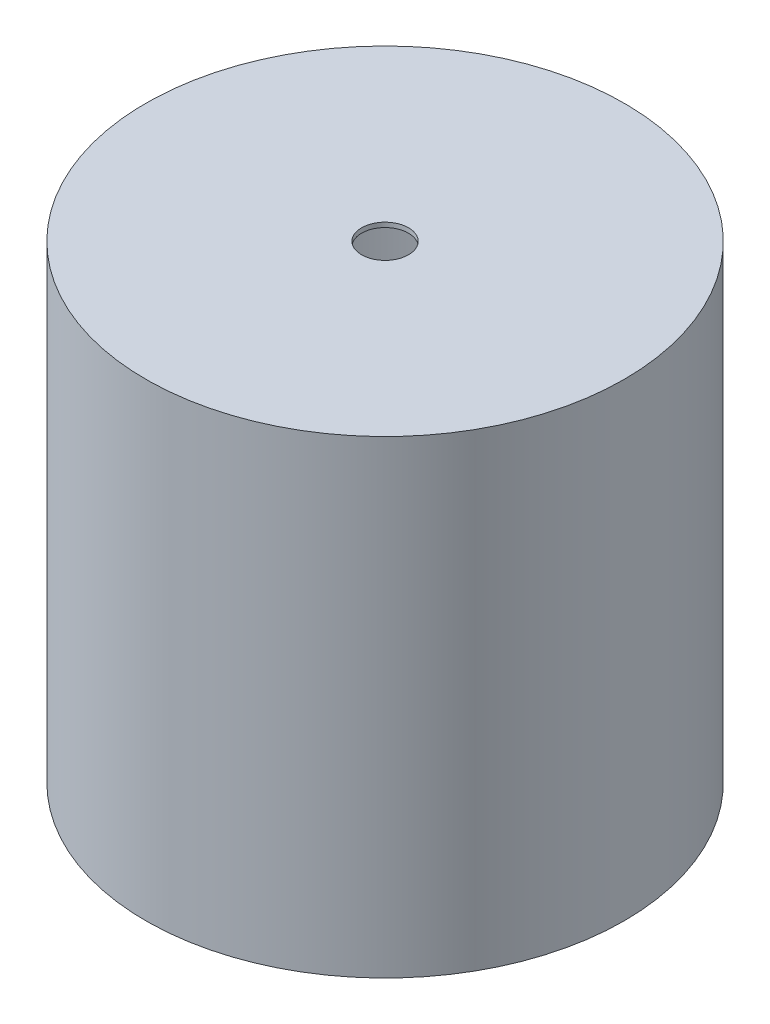
ISO-10303-21;
HEADER;
FILE_DESCRIPTION(('STEP AP214'),'2;1');
FILE_NAME('part.step','',(''),(''),'','','');
FILE_SCHEMA(('AUTOMOTIVE_DESIGN { 1 0 10303 214 1 1 1 1 }'));
ENDSEC;
DATA;
#1=APPLICATION_CONTEXT('core data for automotive mechanical design processes');
#2=APPLICATION_PROTOCOL_DEFINITION('international standard','automotive_design',2000,#1);
#3=PRODUCT_CONTEXT('',#1,'mechanical');
#4=PRODUCT('Part','Part','',(#3));
#5=PRODUCT_RELATED_PRODUCT_CATEGORY('part','',(#4));
#6=PRODUCT_DEFINITION_FORMATION('','',#4);
#7=PRODUCT_DEFINITION_CONTEXT('part definition',#1,'design');
#8=PRODUCT_DEFINITION('design','',#6,#7);
#9=PRODUCT_DEFINITION_SHAPE('','',#8);
#10=(LENGTH_UNIT() NAMED_UNIT(*) SI_UNIT(.MILLI.,.METRE.));
#11=(NAMED_UNIT(*) PLANE_ANGLE_UNIT() SI_UNIT($,.RADIAN.));
#12=(NAMED_UNIT(*) SI_UNIT($,.STERADIAN.) SOLID_ANGLE_UNIT());
#13=UNCERTAINTY_MEASURE_WITH_UNIT(LENGTH_MEASURE(1.E-05),#10,'distance_accuracy_value','');
#14=(GEOMETRIC_REPRESENTATION_CONTEXT(3) GLOBAL_UNCERTAINTY_ASSIGNED_CONTEXT((#13)) GLOBAL_UNIT_ASSIGNED_CONTEXT((#10,
#11,#12)) REPRESENTATION_CONTEXT('',''));
#15=CARTESIAN_POINT('',(0.,0.,0.));
#16=DIRECTION('',(0.,0.,1.));
#17=DIRECTION('',(1.,0.,0.));
#18=AXIS2_PLACEMENT_3D('',#15,#16,#17);
#19=CARTESIAN_POINT('',(0.,100.,0.));
#20=DIRECTION('',(0.,-1.,0.));
#21=DIRECTION('',(0.,0.,-1.));
#22=AXIS2_PLACEMENT_3D('',#19,#20,#21);
#23=CYLINDRICAL_SURFACE('',#22,5.);
#24=CARTESIAN_POINT('',(0.,0.,0.));
#25=DIRECTION('',(0.,-1.,0.));
#26=DIRECTION('',(0.,0.,-1.));
#27=AXIS2_PLACEMENT_3D('',#24,#25,#26);
#28=CIRCLE('',#27,5.);
#29=CARTESIAN_POINT('',(0.,0.,-5.));
#30=VERTEX_POINT('',#29);
#31=EDGE_CURVE('E70',#30,#30,#28,.T.);
#32=ORIENTED_EDGE('',*,*,#31,.T.);
#33=EDGE_LOOP('',(#32));
#34=FACE_BOUND('',#33,.T.);
#35=CARTESIAN_POINT('',(0.,10.,0.));
#36=DIRECTION('',(0.,-1.,0.));
#37=DIRECTION('',(0.,0.,-1.));
#38=AXIS2_PLACEMENT_3D('',#35,#36,#37);
#39=CIRCLE('',#38,5.);
#40=CARTESIAN_POINT('',(0.,10.,-5.));
#41=VERTEX_POINT('',#40);
#42=EDGE_CURVE('E146',#41,#41,#39,.T.);
#43=ORIENTED_EDGE('',*,*,#42,.F.);
#44=EDGE_LOOP('',(#43));
#45=FACE_BOUND('',#44,.T.);
#46=CARTESIAN_POINT('',(-2.5,5.,4.33012701892219));
#47=CARTESIAN_POINT('',(-2.49998948436432,5.13026650687649,4.33013982272991));
#48=CARTESIAN_POINT('',(-2.48974954513168,5.26070272067625,4.33609541965583));
#49=CARTESIAN_POINT('',(-2.44930840724944,5.51756897152923,4.35905877051907));
#50=CARTESIAN_POINT('',(-2.41906526369545,5.64399000405729,4.37608974726023));
#51=CARTESIAN_POINT('',(-2.3402497699757,5.88862894556107,4.41873376871659));
#52=CARTESIAN_POINT('',(-2.29177485369963,6.00688657356221,4.44430111338921));
#53=CARTESIAN_POINT('',(-2.17816884056414,6.23356056309455,4.50106659111455));
#54=CARTESIAN_POINT('',(-2.11303684262671,6.34197639179579,4.53226502875883));
#55=CARTESIAN_POINT('',(-1.96166634317253,6.55576430391692,4.59992173524851));
#56=CARTESIAN_POINT('',(-1.87413008816917,6.66014783448977,4.63660159331577));
#57=CARTESIAN_POINT('',(-1.68313452122752,6.8535209757132,4.70929956727453));
#58=CARTESIAN_POINT('',(-1.57966731506052,6.94250290775495,4.74531734512768));
#59=CARTESIAN_POINT('',(-1.35122390789082,7.10841787648564,4.81553692452135));
#60=CARTESIAN_POINT('',(-1.22526797235894,7.18413441927914,4.84945266064072));
#61=CARTESIAN_POINT('',(-0.960392566671148,7.31285213348386,4.90876890230193));
#62=CARTESIAN_POINT('',(-0.821481345389984,7.3658676404385,4.93417477954535));
#63=CARTESIAN_POINT('',(-0.545112359773524,7.44376165316397,4.9720115311507));
#64=CARTESIAN_POINT('',(-0.408254476210984,7.47037381586513,4.98523700553425));
#65=CARTESIAN_POINT('',(-0.131426571755677,7.50041529671129,5.00018959613973));
#66=CARTESIAN_POINT('',(0.00854151460650773,7.50385864199536,5.00192366961168));
#67=CARTESIAN_POINT('',(0.274581311061964,7.48813331506858,4.99407454791405));
#68=CARTESIAN_POINT('',(0.400802997942671,7.47090496119546,4.98546239730476));
#69=CARTESIAN_POINT('',(0.648284429795109,7.41779789023985,4.95935613149294));
#70=CARTESIAN_POINT('',(0.769543802734625,7.38191777755985,4.94186135165964));
#71=CARTESIAN_POINT('',(1.00577347892407,7.29229358477506,4.89928958219157));
#72=CARTESIAN_POINT('',(1.120633558788,7.23830921706972,4.87411103823003));
#73=CARTESIAN_POINT('',(1.33994200378327,7.11434145949638,4.81844114966712));
#74=CARTESIAN_POINT('',(1.4443866220966,7.04435234174416,4.78794790393709));
#75=CARTESIAN_POINT('',(1.6504341522455,6.88276162116743,4.72110985998075));
#76=CARTESIAN_POINT('',(1.75083518757341,6.78974242918497,4.68448439995438));
#77=CARTESIAN_POINT('',(1.93526092574445,6.58852568767457,4.61135851467029));
#78=CARTESIAN_POINT('',(2.01927302893558,6.48031656931485,4.57485820664072));
#79=CARTESIAN_POINT('',(2.17376333660553,6.24337951893978,4.50360390231212));
#80=CARTESIAN_POINT('',(2.24304328744513,6.11378494236447,4.46910799976769));
#81=CARTESIAN_POINT('',(2.35829778250308,5.84265582160251,4.4093862569644));
#82=CARTESIAN_POINT('',(2.40429664552722,5.7011339174561,4.38415075115168));
#83=CARTESIAN_POINT('',(2.4679505275626,5.42196372179303,4.34861589542586));
#84=CARTESIAN_POINT('',(2.48756280529994,5.28489720239113,4.33729139621241));
#85=CARTESIAN_POINT('',(2.50379236652857,5.00899664620864,4.32794798404024));
#86=CARTESIAN_POINT('',(2.50042589328757,4.87016392720051,4.32991967223279));
#87=CARTESIAN_POINT('',(2.47259010835991,4.6108652035532,4.34585841351462));
#88=CARTESIAN_POINT('',(2.45046954178116,4.49005137223027,4.35848968766635));
#89=CARTESIAN_POINT('',(2.38924071158112,4.25408053432252,4.39235053878353));
#90=CARTESIAN_POINT('',(2.35012694655908,4.13892537313315,4.41358290012585));
#91=CARTESIAN_POINT('',(2.25411897151217,3.91147167274361,4.46340555199141));
#92=CARTESIAN_POINT('',(2.19648515923163,3.79955245786744,4.49229108107657));
#93=CARTESIAN_POINT('',(2.0657176600397,3.5863268211512,4.55390298743125));
#94=CARTESIAN_POINT('',(1.99257601083123,3.48502589121186,4.58663133387872));
#95=CARTESIAN_POINT('',(1.82209291799636,3.28255308119668,4.65719996140836));
#96=CARTESIAN_POINT('',(1.72286318078435,3.18300712322778,4.69516457885708));
#97=CARTESIAN_POINT('',(1.5085112384988,3.00146940499409,4.76835587444746));
#98=CARTESIAN_POINT('',(1.39338368664989,2.91948357434145,4.80358162519329));
#99=CARTESIAN_POINT('',(1.14633840638508,2.77356568520911,4.86853404227334));
#100=CARTESIAN_POINT('',(1.01405774389062,2.71016720479154,4.89809104179855));
#101=CARTESIAN_POINT('',(0.738805911647334,2.60715524003798,4.9470838739847));
#102=CARTESIAN_POINT('',(0.595844253647069,2.56752087039488,4.96652859191746));
#103=CARTESIAN_POINT('',(0.317449205674708,2.51657859064358,4.99168770453968));
#104=CARTESIAN_POINT('',(0.182528609085378,2.50300531416965,4.99849819767838));
#105=CARTESIAN_POINT('',(-0.0878149643374293,2.49789183250541,5.00105325940467));
#106=CARTESIAN_POINT('',(-0.223237748727015,2.50634391433891,4.99680170177042));
#107=CARTESIAN_POINT('',(-0.481344982671071,2.5435410303955,4.97834922085637));
#108=CARTESIAN_POINT('',(-0.604280801321771,2.57091217163631,4.96482236636807));
#109=CARTESIAN_POINT('',(-0.843614873664453,2.64331744975833,4.92980234191731));
#110=CARTESIAN_POINT('',(-0.960012187087212,2.68835411963363,4.90830802955518));
#111=CARTESIAN_POINT('',(-1.18855854199593,2.79681781873926,4.85814826741488));
#112=CARTESIAN_POINT('',(-1.30031295715363,2.86094902468984,4.82921542506803));
#113=CARTESIAN_POINT('',(-1.51193650408535,3.00489411014759,4.76720333344986));
#114=CARTESIAN_POINT('',(-1.61180014305397,3.08471519262687,4.73412218229104));
#115=CARTESIAN_POINT('',(-1.8072854232437,3.26699579444936,4.66321523550925));
#116=CARTESIAN_POINT('',(-1.90149582349003,3.37091772600073,4.62524489658366));
#117=CARTESIAN_POINT('',(-2.07165660492503,3.59361528538223,4.55157698284941));
#118=CARTESIAN_POINT('',(-2.1475908315154,3.71240391419923,4.51588143910584));
#119=CARTESIAN_POINT('',(-2.28108393396028,3.96663611766426,4.44998982823926));
#120=CARTESIAN_POINT('',(-2.3379862797745,4.1024873884246,4.42000320346984));
#121=CARTESIAN_POINT('',(-2.40494911880459,4.31322264951977,4.38370272660093));
#122=CARTESIAN_POINT('',(-2.42419582683991,4.38455977569761,4.37305486646054));
#123=CARTESIAN_POINT('',(-2.45635087255789,4.52904069684933,4.35507574170935));
#124=CARTESIAN_POINT('',(-2.46926364179177,4.60218319095441,4.34774215854234));
#125=CARTESIAN_POINT('',(-2.48591166201423,4.72950098654694,4.3382377954292));
#126=CARTESIAN_POINT('',(-2.49118864979202,4.78341632151221,4.33520487024791));
#127=CARTESIAN_POINT('',(-2.49823512543934,4.89154461631041,4.33114674911323));
#128=CARTESIAN_POINT('',(-2.50000437866475,4.94575759581055,4.33012168747261));
#129=CARTESIAN_POINT('',(-2.5,5.,4.33012701892219));
#130=B_SPLINE_CURVE_WITH_KNOTS('',3,(#46,#47,#48,#49,#50,#51,#52,#53,#54,#55,#56,#57,#58,#59,
#60,#61,#62,#63,#64,#65,#66,#67,#68,#69,#70,#71,#72,#73,#74,#75,#76,#77,#78,#79,#80,#81,#82,#83,
#84,#85,#86,#87,#88,#89,#90,#91,#92,#93,#94,#95,#96,#97,#98,#99,#100,#101,#102,#103,#104,#105,
#106,#107,#108,#109,#110,#111,#112,#113,#114,#115,#116,#117,#118,#119,#120,#121,#122,#123,#124,
#125,#126,#127,#128,#129),.UNSPECIFIED.,.T.,.F.,(4,2,2,2,2,2,2,2,2,2,2,2,2,2,2,2,2,2,2,2,2,2,2,
2,2,2,2,2,2,2,2,2,2,2,2,2,2,2,2,2,2,4),(0.,0.390580306486789,0.781982232062012,1.17132148982692,
1.56068181366371,1.98215578129642,2.40383927716011,2.85394730601992,3.30377067414811,
3.72158712424921,4.13915059220183,4.52040243716429,4.90168281298721,5.2882383683295,
5.67493248380763,6.0981797864731,6.5217512061988,6.97222104328704,7.42221935534346,
7.83655727140613,8.25060232976016,8.61935458565148,8.98822631095241,9.37418241020303,
9.76033715555202,10.1951685895662,10.6301466245059,11.076604535375,11.5226694952701,
11.927806759788,12.3328021699001,12.7111106218382,13.0894733378512,13.4840187680376,
13.8787457525688,14.3127560463025,14.7471485711797,15.195268726016,15.4189244153949,
15.6424233996907,15.8050484542806,15.9676843870379),.UNSPECIFIED.);
#131=CARTESIAN_POINT('',(-2.5,5.,4.33012701892219));
#132=VERTEX_POINT('',#131);
#133=EDGE_CURVE('E102',#132,#132,#130,.T.);
#134=ORIENTED_EDGE('',*,*,#133,.F.);
#135=EDGE_LOOP('',(#134));
#136=FACE_BOUND('',#135,.T.);
#137=CARTESIAN_POINT('',(0.,7.50000000000001,-5.));
#138=CARTESIAN_POINT('',(-0.131426682334305,7.499990330944,-4.99999177550472));
#139=CARTESIAN_POINT('',(-0.263015634437212,7.48957443822597,-4.99476199135277));
#140=CARTESIAN_POINT('',(-0.522301454622883,7.44836817883795,-4.9743541856102));
#141=CARTESIAN_POINT('',(-0.649990448564105,7.41753911907498,-4.9591572718767));
#142=CARTESIAN_POINT('',(-0.897333631316204,7.33701537728116,-4.92040690922477));
#143=CARTESIAN_POINT('',(-1.01701694536277,7.28739401221727,-4.89688595907259));
#144=CARTESIAN_POINT('',(-1.24618160399671,7.17107347374821,-4.84364443325827));
#145=CARTESIAN_POINT('',(-1.3556637520377,7.10437564685491,-4.81392434644421));
#146=CARTESIAN_POINT('',(-1.56876952630998,6.95120686835737,-4.74890645050632));
#147=CARTESIAN_POINT('',(-1.67163802294309,6.86378379977022,-4.71337997659091));
#148=CARTESIAN_POINT('',(-1.86194861703333,6.67369630401471,-4.64149925776731));
#149=CARTESIAN_POINT('',(-1.94937895911556,6.57102037115989,-4.60514440566897));
#150=CARTESIAN_POINT('',(-2.11312999967247,6.34379162555472,-4.53247377945621));
#151=CARTESIAN_POINT('',(-2.18806333849064,6.21815975396499,-4.49637967412567));
#152=CARTESIAN_POINT('',(-2.31542056761491,5.95408166020457,-4.43214946943555));
#153=CARTESIAN_POINT('',(-2.36786053751683,5.81564467823738,-4.40400769020792));
#154=CARTESIAN_POINT('',(-2.44533110537653,5.53833723640359,-4.36144667591402));
#155=CARTESIAN_POINT('',(-2.47181464267578,5.39998886982042,-4.34630678958452));
#156=CARTESIAN_POINT('',(-2.50106748329741,5.12005290556239,-4.3295472487215));
#157=CARTESIAN_POINT('',(-2.50386022093906,4.97846864782491,-4.3279142335843));
#158=CARTESIAN_POINT('',(-2.48671821792512,4.71428493920912,-4.33777325642937));
#159=CARTESIAN_POINT('',(-2.46946139884055,4.59143992194171,-4.34771909154984));
#160=CARTESIAN_POINT('',(-2.41734962264384,4.35069522656805,-4.37690571834675));
#161=CARTESIAN_POINT('',(-2.38248905974454,4.23279713673689,-4.39614947079454));
#162=CARTESIAN_POINT('',(-2.29552445096459,4.00192716858567,-4.44218691031839));
#163=CARTESIAN_POINT('',(-2.24303766778988,3.88913400303548,-4.46914601659992));
#164=CARTESIAN_POINT('',(-2.12260421917012,3.67341426852503,-4.52758510703513));
#165=CARTESIAN_POINT('',(-2.0546506095312,3.57049216099979,-4.55906711950477));
#166=CARTESIAN_POINT('',(-1.89516513728194,3.36369686814192,-4.62782894758213));
#167=CARTESIAN_POINT('',(-1.8017361459232,3.2613578160596,-4.66533775591865));
#168=CARTESIAN_POINT('',(-1.59888894685344,3.07316145352275,-4.73869058251019));
#169=CARTESIAN_POINT('',(-1.48946314143572,2.98731201991529,-4.77453379897003));
#170=CARTESIAN_POINT('',(-1.25129126457962,2.83078584742568,-4.84254968207409));
#171=CARTESIAN_POINT('',(-1.12188397899853,2.76099881888564,-4.87447460405015));
#172=CARTESIAN_POINT('',(-0.851165538721985,2.64475742739248,-4.92894702803109));
#173=CARTESIAN_POINT('',(-0.709863940663162,2.5982845374621,-4.95150197358893));
#174=CARTESIAN_POINT('',(-0.431916229151781,2.53381149070829,-4.98310834353579));
#175=CARTESIAN_POINT('',(-0.295853826370906,2.513771910633,-4.9931234575324));
#176=CARTESIAN_POINT('',(-0.0219489998732886,2.49633817216383,-5.00182533647794));
#177=CARTESIAN_POINT('',(0.115892549675109,2.4989332859015,-5.00051746803426));
#178=CARTESIAN_POINT('',(0.378082429964656,2.5255167210467,-4.98727980633468));
#179=CARTESIAN_POINT('',(0.502648520123706,2.5478313318244,-4.97618114219992));
#180=CARTESIAN_POINT('',(0.746017230755972,2.61059517973838,-4.94555428287529));
#181=CARTESIAN_POINT('',(0.864819214231883,2.65104641613589,-4.92602515837625));
#182=CARTESIAN_POINT('',(1.09722152111965,2.74999616608036,-4.87960628532329));
#183=CARTESIAN_POINT('',(1.21057599249831,2.80897762528232,-4.85252204417873));
#184=CARTESIAN_POINT('',(1.42615340426439,2.94276883912482,-4.7935993579975));
#185=CARTESIAN_POINT('',(1.52837157450203,3.01758533651988,-4.76175888940534));
#186=CARTESIAN_POINT('',(1.72941922315487,3.18940106329089,-4.69270553315087));
#187=CARTESIAN_POINT('',(1.82693019428496,3.2878571709752,-4.65527212009488));
#188=CARTESIAN_POINT('',(2.0046408025722,3.49981287804944,-4.58155978921587));
#189=CARTESIAN_POINT('',(2.08482846428685,3.61332279706986,-4.54528168472407));
#190=CARTESIAN_POINT('',(2.22926978618995,3.85910913548465,-4.4762798054528));
#191=CARTESIAN_POINT('',(2.29256373922243,3.99202816529114,-4.44381323981254));
#192=CARTESIAN_POINT('',(2.39520706511459,4.26877516888255,-4.38935180726746));
#193=CARTESIAN_POINT('',(2.43458729077056,4.41258881599999,-4.36734345549014));
#194=CARTESIAN_POINT('',(2.48465421767005,4.69227555736294,-4.33903752569351));
#195=CARTESIAN_POINT('',(2.4977324874436,4.82758563411897,-4.33143458674096));
#196=CARTESIAN_POINT('',(2.50172288950898,5.09861766738068,-4.32913386592579));
#197=CARTESIAN_POINT('',(2.49264462983266,5.23433941987363,-4.3344304902511));
#198=CARTESIAN_POINT('',(2.45481530197332,5.48870875561685,-4.35594655164663));
#199=CARTESIAN_POINT('',(2.42802074302696,5.60775118172076,-4.37107736338133));
#200=CARTESIAN_POINT('',(2.35793843840544,5.83952029219995,-4.40927540337602));
#201=CARTESIAN_POINT('',(2.31464538728732,5.95224493156654,-4.43234518434965));
#202=CARTESIAN_POINT('',(2.20953919315538,6.17656215271972,-4.48571326433412));
#203=CARTESIAN_POINT('',(2.14667719009404,6.28756985173502,-4.5163930799845));
#204=CARTESIAN_POINT('',(2.0053780838799,6.49818624324004,-4.58088327077455));
#205=CARTESIAN_POINT('',(1.92693287765889,6.59778896262873,-4.61469526970767));
#206=CARTESIAN_POINT('',(1.74550556946066,6.79535536374964,-4.68655816327011));
#207=CARTESIAN_POINT('',(1.6407002246921,6.89164936417137,-4.7246249151498));
#208=CARTESIAN_POINT('',(1.41539785420684,7.06565584942804,-4.79694347383545));
#209=CARTESIAN_POINT('',(1.29489242426333,7.14335831860588,-4.83119321905446));
#210=CARTESIAN_POINT('',(1.03978808878537,7.2780969794841,-4.89245149457782));
#211=CARTESIAN_POINT('',(0.90509556078229,7.33498316778445,-4.91940711437488));
#212=CARTESIAN_POINT('',(0.696328709257353,7.4021838587924,-4.95177960923351));
#213=CARTESIAN_POINT('',(0.62567041349409,7.42155539800181,-4.96122314081874));
#214=CARTESIAN_POINT('',(0.482623997839259,7.4540659483706,-4.97717127275101));
#215=CARTESIAN_POINT('',(0.410236963092403,7.46720876667635,-4.98367766823159));
#216=CARTESIAN_POINT('',(0.281518684621671,7.48473747228463,-4.9923820076613));
#217=CARTESIAN_POINT('',(0.225408499555444,7.49045493653133,-4.99523288466454));
#218=CARTESIAN_POINT('',(0.112875528456288,7.49808832946571,-4.99904367329659));
#219=CARTESIAN_POINT('',(0.0564527338382175,7.50000415322548,-5.00000353273198));
#220=CARTESIAN_POINT('',(0.,7.50000000000001,-5.));
#221=B_SPLINE_CURVE_WITH_KNOTS('',3,(#137,#138,#139,#140,#141,#142,#143,#144,#145,#146,#147,
#148,#149,#150,#151,#152,#153,#154,#155,#156,#157,#158,#159,#160,#161,#162,#163,#164,#165,#166,
#167,#168,#169,#170,#171,#172,#173,#174,#175,#176,#177,#178,#179,#180,#181,#182,#183,#184,#185,
#186,#187,#188,#189,#190,#191,#192,#193,#194,#195,#196,#197,#198,#199,#200,#201,#202,#203,#204,
#205,#206,#207,#208,#209,#210,#211,#212,#213,#214,#215,#216,#217,#218,#219,#220),.UNSPECIFIED.,
.T.,.F.,(4,2,2,2,2,2,2,2,2,2,2,2,2,2,2,2,2,2,2,2,2,2,2,2,2,2,2,2,2,2,2,2,2,2,2,2,2,2,2,2,2,4),
(0.,0.394060643550731,0.788870374272995,1.18215538873075,1.57540940145392,1.99245439679522,
2.40981559413509,2.85954316076882,3.30894869745703,3.73145030350574,4.15353393322551,
4.52514281023302,4.89687009814197,5.27725600421219,5.65781303150555,6.08662353334697,
6.51563836496716,6.96457555536102,7.413155422807,7.82458226178365,8.23581411278691,
8.61517266265306,8.99457304077329,9.38482140069747,9.77523626870849,10.2039902661037,
10.6330397153795,11.0828670540368,11.53211279863,11.9382326875699,12.3441764966107,
12.7114482562151,13.0788382197025,13.4709114195009,13.8631890285845,14.303131068923,
14.7433095845248,15.1866003415819,15.407934939208,15.6291340766843,15.7983933645035,
15.9676573239323),.UNSPECIFIED.);
#222=CARTESIAN_POINT('',(0.,7.50000000000001,-5.));
#223=VERTEX_POINT('',#222);
#224=EDGE_CURVE('E107',#223,#223,#221,.T.);
#225=ORIENTED_EDGE('',*,*,#224,.F.);
#226=EDGE_LOOP('',(#225));
#227=FACE_BOUND('',#226,.T.);
#228=ADVANCED_FACE('F42',(#34,#45,#136,#227),#23,.F.);
#229=CARTESIAN_POINT('',(0.,10.,0.));
#230=DIRECTION('',(0.,-1.,0.));
#231=DIRECTION('',(0.,0.,-1.));
#232=AXIS2_PLACEMENT_3D('',#229,#230,#231);
#233=CYLINDRICAL_SURFACE('',#232,6.);
#234=CARTESIAN_POINT('',(-2.5,5.,5.45435605731786));
#235=CARTESIAN_POINT('',(-2.49999850025921,5.0667081831549,5.45435734054166));
#236=CARTESIAN_POINT('',(-2.49732449538893,5.13343479216854,5.45558543289999));
#237=CARTESIAN_POINT('',(-2.48666416485593,5.26638647840299,5.460451257595));
#238=CARTESIAN_POINT('',(-2.47867468210215,5.3326112338951,5.46409042196574));
#239=CARTESIAN_POINT('',(-2.44679265931592,5.53005186677056,5.47848490817198));
#240=CARTESIAN_POINT('',(-2.41498683408238,5.65983681642949,5.49271671920563));
#241=CARTESIAN_POINT('',(-2.33180001337599,5.91115476413125,5.52853615769555));
#242=CARTESIAN_POINT('',(-2.28049881438598,6.03271905209161,5.55009376241033));
#243=CARTESIAN_POINT('',(-2.16001268934738,6.26551017655699,5.59808356001864));
#244=CARTESIAN_POINT('',(-2.09083199376537,6.37673944997679,5.62451459938574));
#245=CARTESIAN_POINT('',(-1.93194778443699,6.59265398208942,5.68111508149861));
#246=CARTESIAN_POINT('',(-1.84130648149063,6.69661579704746,5.71141131571832));
#247=CARTESIAN_POINT('',(-1.64404334636732,6.88839976517447,5.77128595332676));
#248=CARTESIAN_POINT('',(-1.53741538134829,6.97621569551115,5.80086407614999));
#249=CARTESIAN_POINT('',(-1.30552678905514,7.13689925552864,5.8575107455344));
#250=CARTESIAN_POINT('',(-1.17965858775786,7.20895330788146,5.88441479600862));
#251=CARTESIAN_POINT('',(-0.91626404433434,7.33055198921748,5.93113040336416));
#252=CARTESIAN_POINT('',(-0.778742909642266,7.38010661039742,5.95094510785638));
#253=CARTESIAN_POINT('',(-0.503536996147009,7.45267893034036,5.98035041998161));
#254=CARTESIAN_POINT('',(-0.366233152418011,7.47694339323322,5.99041942231785));
#255=CARTESIAN_POINT('',(-0.0891583607041747,7.50227527889198,6.00093657245546));
#256=CARTESIAN_POINT('',(0.0506115635357653,7.50335211087423,6.00138862268061));
#257=CARTESIAN_POINT('',(0.319585560218813,7.48293143897079,5.99290258260449));
#258=CARTESIAN_POINT('',(0.448914977212893,7.46280379917312,5.98453429295767));
#259=CARTESIAN_POINT('',(0.702165787864647,7.40289379449909,5.96013033502178));
#260=CARTESIAN_POINT('',(0.826086782110447,7.36310998067885,5.94409410149732));
#261=CARTESIAN_POINT('',(1.06727623615443,7.26454391827247,5.90559704827471));
#262=CARTESIAN_POINT('',(1.18441435414909,7.20548107427576,5.88304194251414));
#263=CARTESIAN_POINT('',(1.40742353456465,7.0703084865819,5.83371427980366));
#264=CARTESIAN_POINT('',(1.51329059551624,6.99419271830215,5.80694023334947));
#265=CARTESIAN_POINT('',(1.7186818234134,6.8208351591992,5.74963397551512));
#266=CARTESIAN_POINT('',(1.81723287462318,6.72248241745696,5.71896988702082));
#267=CARTESIAN_POINT('',(1.99686282986464,6.51057711857186,5.65875721372882));
#268=CARTESIAN_POINT('',(2.0779349916834,6.39701872336434,5.62920906299901));
#269=CARTESIAN_POINT('',(2.22280378497075,6.15320992672028,5.57363224672088));
#270=CARTESIAN_POINT('',(2.28594506698397,6.02253358869451,5.54775116967603));
#271=CARTESIAN_POINT('',(2.38892864103959,5.75103791023744,5.50419688296717));
#272=CARTESIAN_POINT('',(2.42878759251238,5.61022590351575,5.48651780631503));
#273=CARTESIAN_POINT('',(2.48160050339178,5.33220638213301,5.46282425074792));
#274=CARTESIAN_POINT('',(2.49613229266517,5.19535775547148,5.45612738403682));
#275=CARTESIAN_POINT('',(2.50251261037213,4.92104303518741,5.45320573611839));
#276=CARTESIAN_POINT('',(2.49436898636095,4.78357717161926,5.45697733196184));
#277=CARTESIAN_POINT('',(2.45706955131303,4.5212032291366,5.47386262693795));
#278=CARTESIAN_POINT('',(2.42929237636148,4.39605462642581,5.48636276033852));
#279=CARTESIAN_POINT('',(2.355341171284,4.15229740700485,5.51851260594277));
#280=CARTESIAN_POINT('',(2.30916284106238,4.03369032633843,5.53816398920152));
#281=CARTESIAN_POINT('',(2.19755041610386,3.80076937928722,5.58341595714177));
#282=CARTESIAN_POINT('',(2.13138366612393,3.68685005078064,5.60923324404617));
#283=CARTESIAN_POINT('',(1.98240156877197,3.47118389500067,5.66360007481535));
#284=CARTESIAN_POINT('',(1.89957901575222,3.36944236659127,5.69215079841133));
#285=CARTESIAN_POINT('',(1.71168891143075,3.17239973023739,5.75157239569101));
#286=CARTESIAN_POINT('',(1.6053593229584,3.07829720011966,5.78244293417774));
#287=CARTESIAN_POINT('',(1.37770302510816,2.90905541602036,5.84086722367755));
#288=CARTESIAN_POINT('',(1.25637521761135,2.8339175517941,5.86842073153699));
#289=CARTESIAN_POINT('',(1.00130936160273,2.70482024919155,5.91728503171628));
#290=CARTESIAN_POINT('',(0.867540339261896,2.65091551771517,5.93857966278875));
#291=CARTESIAN_POINT('',(0.591717670323946,2.56676641503718,5.9723634620551));
#292=CARTESIAN_POINT('',(0.449669008506775,2.536507962451,5.98485787035281));
#293=CARTESIAN_POINT('',(0.172033066960383,2.50228374997958,5.9990306959926));
#294=CARTESIAN_POINT('',(0.0366881693984337,2.49662800428995,6.0014040908376));
#295=CARTESIAN_POINT('',(-0.232973623239239,2.50722627890465,5.99699046946599));
#296=CARTESIAN_POINT('',(-0.367290694377477,2.52347645831395,5.99020505911644));
#297=CARTESIAN_POINT('',(-0.626172965578197,2.5762121575427,5.96860132018429));
#298=CARTESIAN_POINT('',(-0.750915078182085,2.61195940947576,5.9540764862017));
#299=CARTESIAN_POINT('',(-0.992584458507238,2.70186844587238,5.91858999492374));
#300=CARTESIAN_POINT('',(-1.1095102366691,2.75603372835824,5.89762711496349));
#301=CARTESIAN_POINT('',(-1.33804914068053,2.88397924757924,5.85011651583377));
#302=CARTESIAN_POINT('',(-1.44918335299799,2.95853532351305,5.82335921372399));
#303=CARTESIAN_POINT('',(-1.65783731421916,3.12401364481073,5.7674312075248));
#304=CARTESIAN_POINT('',(-1.75535198504112,3.21494196583612,5.73825960968076));
#305=CARTESIAN_POINT('',(-1.9408997224229,3.41789253007209,5.67829702479813));
#306=CARTESIAN_POINT('',(-2.02783607699356,3.53092911202995,5.64753091772368));
#307=CARTESIAN_POINT('',(-2.18166607575475,3.77090639200073,5.5899105903639));
#308=CARTESIAN_POINT('',(-2.24854851583746,3.89785480866736,5.56305856115973));
#309=CARTESIAN_POINT('',(-2.35965744264203,4.16192893335946,5.51685287460303));
#310=CARTESIAN_POINT('',(-2.40400437258696,4.29899595514957,5.49745949216625));
#311=CARTESIAN_POINT('',(-2.45239925350778,4.50916376906638,5.47594959049764));
#312=CARTESIAN_POINT('',(-2.46550603347808,4.57991059795605,5.47004503557757));
#313=CARTESIAN_POINT('',(-2.48558130943928,4.72242605641858,5.46095373466208));
#314=CARTESIAN_POINT('',(-2.49255414024397,4.79419392792262,5.45776506941946));
#315=CARTESIAN_POINT('',(-2.49880479670823,4.91071160563903,5.45490391727668));
#316=CARTESIAN_POINT('',(-2.50000100378859,4.9553516756734,5.45435519844583));
#317=CARTESIAN_POINT('',(-2.5,5.,5.45435605731786));
#318=B_SPLINE_CURVE_WITH_KNOTS('',3,(#234,#235,#236,#237,#238,#239,#240,#241,#242,#243,#244,
#245,#246,#247,#248,#249,#250,#251,#252,#253,#254,#255,#256,#257,#258,#259,#260,#261,#262,#263,
#264,#265,#266,#267,#268,#269,#270,#271,#272,#273,#274,#275,#276,#277,#278,#279,#280,#281,#282,
#283,#284,#285,#286,#287,#288,#289,#290,#291,#292,#293,#294,#295,#296,#297,#298,#299,#300,#301,
#302,#303,#304,#305,#306,#307,#308,#309,#310,#311,#312,#313,#314,#315,#316,#317),.UNSPECIFIED.,
.T.,.F.,(4,2,2,2,2,2,2,2,2,2,2,2,2,2,2,2,2,2,2,2,2,2,2,2,2,2,2,2,2,2,2,2,2,2,2,2,2,2,2,2,2,4),
(0.,0.200084575093045,0.400288095243582,0.801278994956904,1.20064597557678,1.59991854837275,
2.02172149988563,2.44368668047077,2.88395420283104,3.32402600677038,3.7411967908316,
4.15819828963116,4.54982147617441,4.94147353531023,5.33910096407387,5.73686909172224,
6.16267530816225,6.58864548009989,7.0286155846392,7.46827048625635,7.87940023747112,
8.29038772171394,8.67506269266881,9.05982760961556,9.46088720770835,9.86212068725428,
10.2960179260552,10.7299469521823,11.1649867904569,11.5997673642051,12.004157373226,
12.4084764873833,12.7984529720747,13.1885035639884,13.5961819279257,14.0040118923231,
14.4395932095167,14.8754174341574,15.3088871873109,15.5252058174741,15.7413714538654,
15.8752896716763),.UNSPECIFIED.);
#319=CARTESIAN_POINT('',(-2.5,5.,5.45435605731786));
#320=VERTEX_POINT('',#319);
#321=EDGE_CURVE('E82',#320,#320,#318,.T.);
#322=ORIENTED_EDGE('',*,*,#321,.T.);
#323=EDGE_LOOP('',(#322));
#324=FACE_BOUND('',#323,.T.);
#325=CARTESIAN_POINT('',(0.,0.999999999999999,0.));
#326=DIRECTION('',(0.,1.,0.));
#327=DIRECTION('',(0.,0.,1.));
#328=AXIS2_PLACEMENT_3D('',#325,#326,#327);
#329=CIRCLE('',#328,6.);
#330=CARTESIAN_POINT('',(0.,0.999999999999999,6.));
#331=VERTEX_POINT('',#330);
#332=EDGE_CURVE('E11',#331,#331,#329,.T.);
#333=ORIENTED_EDGE('',*,*,#332,.T.);
#334=EDGE_LOOP('',(#333));
#335=FACE_BOUND('',#334,.T.);
#336=CARTESIAN_POINT('',(0.,10.,0.));
#337=DIRECTION('',(0.,-1.,0.));
#338=DIRECTION('',(1.,0.,0.));
#339=AXIS2_PLACEMENT_3D('',#336,#337,#338);
#340=CIRCLE('',#339,6.);
#341=CARTESIAN_POINT('',(6.,10.,0.));
#342=VERTEX_POINT('',#341);
#343=EDGE_CURVE('E64',#342,#342,#340,.T.);
#344=ORIENTED_EDGE('',*,*,#343,.T.);
#345=EDGE_LOOP('',(#344));
#346=FACE_BOUND('',#345,.T.);
#347=CARTESIAN_POINT('',(0.,7.5,-6.));
#348=CARTESIAN_POINT('',(-0.133903918163791,7.4999952878604,-5.99999628290907));
#349=CARTESIAN_POINT('',(-0.268039524991425,7.48917868439947,-5.99546656821164));
#350=CARTESIAN_POINT('',(-0.532498019991114,7.44631926190638,-5.97780115788617));
#351=CARTESIAN_POINT('',(-0.66281002980867,7.41422105321848,-5.96464300599791));
#352=CARTESIAN_POINT('',(-0.915376593299225,7.3301785119407,-5.93112629106012));
#353=CARTESIAN_POINT('',(-1.03765681434384,7.27830140767691,-5.91079213642029));
#354=CARTESIAN_POINT('',(-1.27165974779733,7.15645416697814,-5.8649055925345));
#355=CARTESIAN_POINT('',(-1.38338564416287,7.08648951102524,-5.83935478441347));
#356=CARTESIAN_POINT('',(-1.59889674004597,6.92674208819246,-5.78415660619864));
#357=CARTESIAN_POINT('',(-1.70208251703042,6.8361973967483,-5.75437507703432));
#358=CARTESIAN_POINT('',(-1.8923196601971,6.63947131609954,-5.69465427085228));
#359=CARTESIAN_POINT('',(-1.9793625312399,6.53328174628491,-5.66471491925558));
#360=CARTESIAN_POINT('',(-2.13907474876483,6.30194644898946,-5.60642043928224));
#361=CARTESIAN_POINT('',(-2.21082616169411,6.17612510424857,-5.57821573827599));
#362=CARTESIAN_POINT('',(-2.331878813161,5.91285348305706,-5.52871144633222));
#363=CARTESIAN_POINT('',(-2.38119161708799,5.77540924074289,-5.50740829980501));
#364=CARTESIAN_POINT('',(-2.45349196589845,5.49969261673848,-5.47557110795537));
#365=CARTESIAN_POINT('',(-2.47763315746001,5.36177903328898,-5.46456775308951));
#366=CARTESIAN_POINT('',(-2.50250419944798,5.08345341455361,-5.45322652433633));
#367=CARTESIAN_POINT('',(-2.5032469611117,4.94304279992962,-5.45288276849133));
#368=CARTESIAN_POINT('',(-2.48216900725155,4.67519987914758,-5.46250239122985));
#369=CARTESIAN_POINT('',(-2.46207362224014,4.54759780687576,-5.47167765447588));
#370=CARTESIAN_POINT('',(-2.40278382032142,4.29777581799454,-5.49796965547249));
#371=CARTESIAN_POINT('',(-2.36358574574513,4.17555693701519,-5.51508791407034));
#372=CARTESIAN_POINT('',(-2.2664391745498,3.93688459401841,-5.55572369545608));
#373=CARTESIAN_POINT('',(-2.20810943078429,3.82060915817359,-5.57936963898298));
#374=CARTESIAN_POINT('',(-2.07462485161169,3.59904453223936,-5.63036662282146));
#375=CARTESIAN_POINT('',(-1.99946338103921,3.49375969877287,-5.65771912259552));
#376=CARTESIAN_POINT('',(-1.82699193108754,3.28780008253443,-5.71585953755966));
#377=CARTESIAN_POINT('',(-1.72834696641502,3.18826686522915,-5.74674242808947));
#378=CARTESIAN_POINT('',(-1.51545918210306,3.00677299408161,-5.80651346225056));
#379=CARTESIAN_POINT('',(-1.40121271889693,2.92481645661563,-5.83540113754019));
#380=CARTESIAN_POINT('',(-1.15689589738675,2.77912835276747,-5.88876567112946));
#381=CARTESIAN_POINT('',(-1.02652116489536,2.71586110969864,-5.91312533086667));
#382=CARTESIAN_POINT('',(-0.755704805053669,2.61255772079348,-5.95378962829606));
#383=CARTESIAN_POINT('',(-0.615268789590073,2.57250873611236,-5.970098716916));
#384=CARTESIAN_POINT('',(-0.337856226692458,2.51916801574672,-5.9919928237277));
#385=CARTESIAN_POINT('',(-0.201222570557281,2.5043442851125,-5.9981908209425));
#386=CARTESIAN_POINT('',(0.0727093109921755,2.49730755277181,-6.00112100737489));
#387=CARTESIAN_POINT('',(0.210007334305269,2.505088059496,-5.99785591423878));
#388=CARTESIAN_POINT('',(0.47419648468287,2.54194216961213,-5.9826243531388));
#389=CARTESIAN_POINT('',(0.601265933278775,2.56993990819439,-5.97109774567979));
#390=CARTESIAN_POINT('',(0.848765497942178,2.64493638908157,-5.94097213544829));
#391=CARTESIAN_POINT('',(0.969194773036712,2.69193753190061,-5.92237223919408));
#392=CARTESIAN_POINT('',(1.20421799973828,2.80514195142422,-5.87916541290331));
#393=CARTESIAN_POINT('',(1.31851447371068,2.87189636629204,-5.85438982938561));
#394=CARTESIAN_POINT('',(1.53469243246282,3.02210675558341,-5.80147609158182));
#395=CARTESIAN_POINT('',(1.63656870520375,3.10556970305865,-5.77333653537473));
#396=CARTESIAN_POINT('',(1.83266686054867,3.2938064665447,-5.71424175790867));
#397=CARTESIAN_POINT('',(1.92582139596023,3.3996770059721,-5.68322903182028));
#398=CARTESIAN_POINT('',(2.09333969221046,3.6260425518712,-5.6236867353604));
#399=CARTESIAN_POINT('',(2.16769918571027,3.74654087034502,-5.59515772986987));
#400=CARTESIAN_POINT('',(2.2963192041761,4.00122835060357,-5.54362772487864));
#401=CARTESIAN_POINT('',(2.35027836475451,4.13558807102374,-5.52071125109802));
#402=CARTESIAN_POINT('',(2.43434827902354,4.41274118762612,-5.48416711318334));
#403=CARTESIAN_POINT('',(2.46447869724417,4.55552752498876,-5.47053179113073));
#404=CARTESIAN_POINT('',(2.49808160700532,4.83363739837805,-5.45526329073079));
#405=CARTESIAN_POINT('',(2.50342760836084,4.96868932451194,-5.45278701929113));
#406=CARTESIAN_POINT('',(2.49231151038001,5.23768572235548,-5.45787706027259));
#407=CARTESIAN_POINT('',(2.47585275892879,5.3716303609001,-5.46544183100007));
#408=CARTESIAN_POINT('',(2.42316809595845,5.62818549467776,-5.48899102586044));
#409=CARTESIAN_POINT('',(2.38789807270203,5.75103334597753,-5.50456709625453));
#410=CARTESIAN_POINT('',(2.29952656276963,5.98909604366397,-5.54206362465904));
#411=CARTESIAN_POINT('',(2.24642006560089,6.10430873433601,-5.56398586515028));
#412=CARTESIAN_POINT('',(2.1202057237392,6.33139178814705,-5.61333908853254));
#413=CARTESIAN_POINT('',(2.04608723750136,6.44264464594781,-5.64102204404079));
#414=CARTESIAN_POINT('',(1.88136812596239,6.65172029311513,-5.69807379131314));
#415=CARTESIAN_POINT('',(1.79076178563716,6.74953840503241,-5.72744316520043));
#416=CARTESIAN_POINT('',(1.58780416898838,6.93629730561753,-5.78712781593092));
#417=CARTESIAN_POINT('',(1.47434977868814,7.0240726428278,-5.81735619175009));
#418=CARTESIAN_POINT('',(1.23319985958043,7.17939913004211,-5.87320303099821));
#419=CARTESIAN_POINT('',(1.1054978774169,7.24694106399683,-5.89881939160172));
#420=CARTESIAN_POINT('',(0.841465213422197,7.3584188704516,-5.94218308378895));
#421=CARTESIAN_POINT('',(0.70531205641587,7.40272649429008,-5.96005349044659));
#422=CARTESIAN_POINT('',(0.426816782070271,7.46741568752959,-5.9864223497589));
#423=CARTESIAN_POINT('',(0.284495506121992,7.48787216820581,-5.99495014042422));
#424=CARTESIAN_POINT('',(0.118052512349439,7.49732384178622,-5.99888566614291));
#425=CARTESIAN_POINT('',(0.0944569348794044,7.49832660250303,-5.99930292614998));
#426=CARTESIAN_POINT('',(0.0472433090693372,7.49966509825678,-5.99986042138656));
#427=CARTESIAN_POINT('',(0.023625260665151,7.50000083138364,-6.0000006558228));
#428=CARTESIAN_POINT('',(0.,7.5,-6.));
#429=B_SPLINE_CURVE_WITH_KNOTS('',3,(#347,#348,#349,#350,#351,#352,#353,#354,#355,#356,#357,
#358,#359,#360,#361,#362,#363,#364,#365,#366,#367,#368,#369,#370,#371,#372,#373,#374,#375,#376,
#377,#378,#379,#380,#381,#382,#383,#384,#385,#386,#387,#388,#389,#390,#391,#392,#393,#394,#395,
#396,#397,#398,#399,#400,#401,#402,#403,#404,#405,#406,#407,#408,#409,#410,#411,#412,#413,#414,
#415,#416,#417,#418,#419,#420,#421,#422,#423,#424,#425,#426,#427,#428),.UNSPECIFIED.,.T.,.F.,(4,
2,2,2,2,2,2,2,2,2,2,2,2,2,2,2,2,2,2,2,2,2,2,2,2,2,2,2,2,2,2,2,2,2,2,2,2,2,2,2,4),(0.,
0.401613837767878,0.804277081257394,1.2055837038126,1.60676887370595,2.02635872577614,
2.44616876262931,2.88663449078251,3.32687293461176,3.74590546275116,4.16470676498093,
4.55140314405113,4.93817359454426,5.3331742611743,5.72833091434414,6.15688282255794,
6.58553498629177,7.02408110121627,7.46238448436595,7.87296886786503,8.28343534986345,
8.67353179471444,9.06367753203571,9.46594270544323,9.86837610938993,10.2995697605859,
10.7308612248068,11.1682957671905,11.6053689414916,12.0087975511929,12.4121642259507,
12.7967529992953,13.1814498990123,13.5892778679488,13.9972474685189,14.4349307000978,
14.8728129885717,15.3034571163877,15.7327450093864,15.8036033125922,15.8744618187069),.UNSPECIFIED.);
#430=CARTESIAN_POINT('',(0.,7.5,-6.));
#431=VERTEX_POINT('',#430);
#432=EDGE_CURVE('E46',#431,#431,#429,.T.);
#433=ORIENTED_EDGE('',*,*,#432,.T.);
#434=EDGE_LOOP('',(#433));
#435=FACE_BOUND('',#434,.T.);
#436=ADVANCED_FACE('F87',(#324,#335,#346,#435),#233,.T.);
#437=CARTESIAN_POINT('',(0.,1.,0.));
#438=DIRECTION('',(0.,1.,0.));
#439=DIRECTION('',(0.,0.,1.));
#440=AXIS2_PLACEMENT_3D('',#437,#438,#439);
#441=PLANE('',#440);
#442=ORIENTED_EDGE('',*,*,#332,.F.);
#443=EDGE_LOOP('',(#442));
#444=FACE_BOUND('',#443,.T.);
#445=CARTESIAN_POINT('',(0.,1.,0.));
#446=DIRECTION('',(0.,1.,0.));
#447=DIRECTION('',(0.,0.,1.));
#448=AXIS2_PLACEMENT_3D('',#445,#446,#447);
#449=CIRCLE('',#448,50.);
#450=CARTESIAN_POINT('',(0.,1.,50.));
#451=VERTEX_POINT('',#450);
#452=EDGE_CURVE('E55',#451,#451,#449,.T.);
#453=ORIENTED_EDGE('',*,*,#452,.T.);
#454=EDGE_LOOP('',(#453));
#455=FACE_BOUND('',#454,.T.);
#456=ADVANCED_FACE('F122',(#444,#455),#441,.T.);
#457=CARTESIAN_POINT('',(0.,100.,0.));
#458=DIRECTION('',(0.,-1.,0.));
#459=DIRECTION('',(0.,0.,-1.));
#460=AXIS2_PLACEMENT_3D('',#457,#458,#459);
#461=CYLINDRICAL_SURFACE('',#460,50.);
#462=ORIENTED_EDGE('',*,*,#452,.F.);
#463=EDGE_LOOP('',(#462));
#464=FACE_BOUND('',#463,.T.);
#465=CARTESIAN_POINT('',(0.,99.,0.));
#466=DIRECTION('',(0.,1.,0.));
#467=DIRECTION('',(0.,0.,1.));
#468=AXIS2_PLACEMENT_3D('',#465,#466,#467);
#469=CIRCLE('',#468,50.);
#470=CARTESIAN_POINT('',(0.,99.,50.));
#471=VERTEX_POINT('',#470);
#472=EDGE_CURVE('E73',#471,#471,#469,.T.);
#473=ORIENTED_EDGE('',*,*,#472,.T.);
#474=EDGE_LOOP('',(#473));
#475=FACE_BOUND('',#474,.T.);
#476=ADVANCED_FACE('F120',(#464,#475),#461,.F.);
#477=CARTESIAN_POINT('',(0.,99.,0.));
#478=DIRECTION('',(0.,1.,0.));
#479=DIRECTION('',(0.,0.,1.));
#480=AXIS2_PLACEMENT_3D('',#477,#478,#479);
#481=PLANE('',#480);
#482=CARTESIAN_POINT('',(0.,99.,0.));
#483=DIRECTION('',(0.,1.,0.));
#484=DIRECTION('',(0.,0.,1.));
#485=AXIS2_PLACEMENT_3D('',#482,#483,#484);
#486=CIRCLE('',#485,5.);
#487=CARTESIAN_POINT('',(0.,99.,5.));
#488=VERTEX_POINT('',#487);
#489=EDGE_CURVE('E69',#488,#488,#486,.T.);
#490=ORIENTED_EDGE('',*,*,#489,.T.);
#491=EDGE_LOOP('',(#490));
#492=FACE_BOUND('',#491,.T.);
#493=ORIENTED_EDGE('',*,*,#472,.F.);
#494=EDGE_LOOP('',(#493));
#495=FACE_BOUND('',#494,.T.);
#496=ADVANCED_FACE('F116',(#492,#495),#481,.F.);
#497=CARTESIAN_POINT('',(0.,100.,0.));
#498=DIRECTION('',(0.,-1.,0.));
#499=DIRECTION('',(0.,0.,-1.));
#500=AXIS2_PLACEMENT_3D('',#497,#498,#499);
#501=CIRCLE('',#500,5.);
#502=CARTESIAN_POINT('',(0.,100.,-5.));
#503=VERTEX_POINT('',#502);
#504=EDGE_CURVE('E66',#503,#503,#501,.T.);
#505=ORIENTED_EDGE('',*,*,#504,.F.);
#506=EDGE_LOOP('',(#505));
#507=FACE_BOUND('',#506,.T.);
#508=ORIENTED_EDGE('',*,*,#489,.F.);
#509=EDGE_LOOP('',(#508));
#510=FACE_BOUND('',#509,.T.);
#511=ADVANCED_FACE('F115',(#507,#510),#23,.F.);
#512=CARTESIAN_POINT('',(0.,100.,0.));
#513=DIRECTION('',(0.,1.,0.));
#514=DIRECTION('',(0.,0.,1.));
#515=AXIS2_PLACEMENT_3D('',#512,#513,#514);
#516=PLANE('',#515);
#517=ORIENTED_EDGE('',*,*,#504,.T.);
#518=EDGE_LOOP('',(#517));
#519=FACE_BOUND('',#518,.T.);
#520=CARTESIAN_POINT('',(0.,100.,0.));
#521=DIRECTION('',(0.,1.,0.));
#522=DIRECTION('',(1.,0.,0.));
#523=AXIS2_PLACEMENT_3D('',#520,#521,#522);
#524=CIRCLE('',#523,51.);
#525=CARTESIAN_POINT('',(51.,100.,0.));
#526=VERTEX_POINT('',#525);
#527=EDGE_CURVE('E60',#526,#526,#524,.T.);
#528=ORIENTED_EDGE('',*,*,#527,.T.);
#529=EDGE_LOOP('',(#528));
#530=FACE_BOUND('',#529,.T.);
#531=ADVANCED_FACE('F129',(#519,#530),#516,.T.);
#532=CARTESIAN_POINT('',(0.,0.,0.));
#533=DIRECTION('',(0.,1.,0.));
#534=DIRECTION('',(0.,0.,1.));
#535=AXIS2_PLACEMENT_3D('',#532,#533,#534);
#536=PLANE('',#535);
#537=CARTESIAN_POINT('',(0.,0.,0.));
#538=DIRECTION('',(0.,1.,0.));
#539=DIRECTION('',(1.,0.,0.));
#540=AXIS2_PLACEMENT_3D('',#537,#538,#539);
#541=CIRCLE('',#540,51.);
#542=CARTESIAN_POINT('',(51.,0.,0.));
#543=VERTEX_POINT('',#542);
#544=EDGE_CURVE('E76',#543,#543,#541,.T.);
#545=ORIENTED_EDGE('',*,*,#544,.F.);
#546=EDGE_LOOP('',(#545));
#547=FACE_BOUND('',#546,.T.);
#548=ORIENTED_EDGE('',*,*,#31,.F.);
#549=EDGE_LOOP('',(#548));
#550=FACE_BOUND('',#549,.T.);
#551=ADVANCED_FACE('F131',(#547,#550),#536,.F.);
#552=CARTESIAN_POINT('',(0.,100.,0.));
#553=DIRECTION('',(0.,-1.,0.));
#554=DIRECTION('',(0.,0.,-1.));
#555=AXIS2_PLACEMENT_3D('',#552,#553,#554);
#556=CYLINDRICAL_SURFACE('',#555,51.);
#557=ORIENTED_EDGE('',*,*,#527,.F.);
#558=EDGE_LOOP('',(#557));
#559=FACE_BOUND('',#558,.T.);
#560=ORIENTED_EDGE('',*,*,#544,.T.);
#561=EDGE_LOOP('',(#560));
#562=FACE_BOUND('',#561,.T.);
#563=ADVANCED_FACE('F44',(#559,#562),#556,.T.);
#564=CARTESIAN_POINT('',(0.,10.,0.));
#565=DIRECTION('',(0.,-1.,0.));
#566=DIRECTION('',(0.,0.,-1.));
#567=AXIS2_PLACEMENT_3D('',#564,#565,#566);
#568=PLANE('',#567);
#569=ORIENTED_EDGE('',*,*,#42,.T.);
#570=EDGE_LOOP('',(#569));
#571=FACE_BOUND('',#570,.T.);
#572=ORIENTED_EDGE('',*,*,#343,.F.);
#573=EDGE_LOOP('',(#572));
#574=FACE_BOUND('',#573,.T.);
#575=ADVANCED_FACE('F96',(#571,#574),#568,.F.);
#576=CARTESIAN_POINT('',(0.,5.,20.));
#577=DIRECTION('',(0.,0.,-1.));
#578=DIRECTION('',(-1.,0.,0.));
#579=AXIS2_PLACEMENT_3D('',#576,#577,#578);
#580=CYLINDRICAL_SURFACE('',#579,2.5);
#581=ORIENTED_EDGE('',*,*,#321,.F.);
#582=EDGE_LOOP('',(#581));
#583=FACE_BOUND('',#582,.T.);
#584=ORIENTED_EDGE('',*,*,#133,.T.);
#585=EDGE_LOOP('',(#584));
#586=FACE_BOUND('',#585,.T.);
#587=ADVANCED_FACE('F94',(#583,#586),#580,.F.);
#588=ORIENTED_EDGE('',*,*,#432,.F.);
#589=EDGE_LOOP('',(#588));
#590=FACE_BOUND('',#589,.T.);
#591=ORIENTED_EDGE('',*,*,#224,.T.);
#592=EDGE_LOOP('',(#591));
#593=FACE_BOUND('',#592,.T.);
#594=ADVANCED_FACE('F91',(#590,#593),#580,.F.);
#595=CLOSED_SHELL('',(#228,#436,#456,#476,#496,#511,#531,#551,#563,#575,#587,#594));
#596=MANIFOLD_SOLID_BREP('B2',#595);
#597=ADVANCED_BREP_SHAPE_REPRESENTATION('',(#18,#596),#14);
#598=SHAPE_DEFINITION_REPRESENTATION(#9,#597);
ENDSEC;
END-ISO-10303-21;
